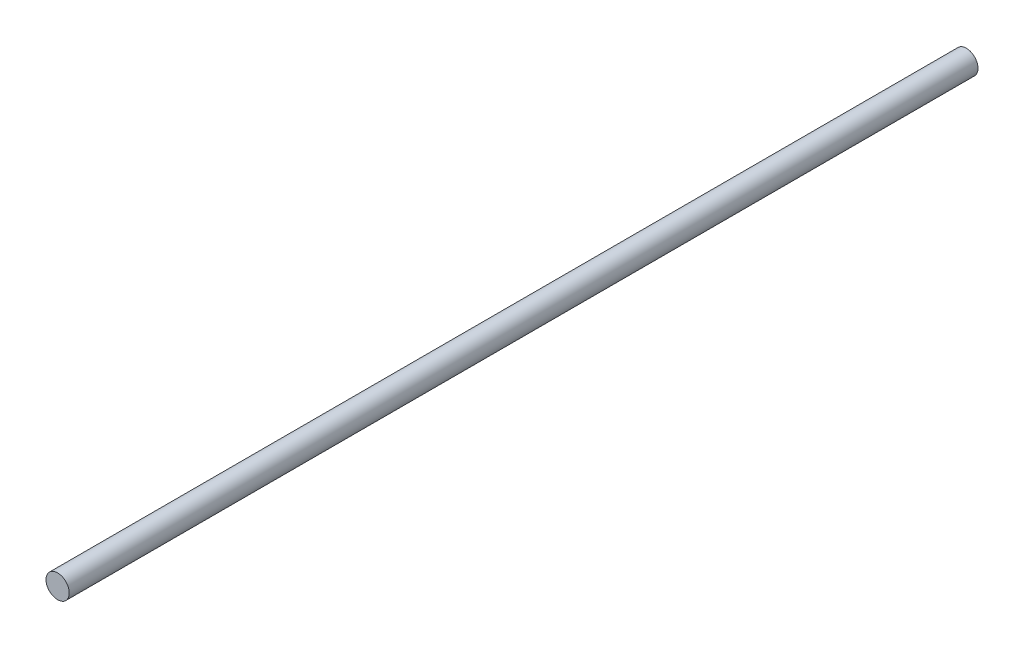
ISO-10303-21;
HEADER;
FILE_DESCRIPTION(('STEP AP214'),'2;1');
FILE_NAME('part.step','',(''),(''),'','','');
FILE_SCHEMA(('AUTOMOTIVE_DESIGN { 1 0 10303 214 1 1 1 1 }'));
ENDSEC;
DATA;
#1=APPLICATION_CONTEXT('core data for automotive mechanical design processes');
#2=APPLICATION_PROTOCOL_DEFINITION('international standard','automotive_design',2000,#1);
#3=PRODUCT_CONTEXT('',#1,'mechanical');
#4=PRODUCT('Part','Part','',(#3));
#5=PRODUCT_RELATED_PRODUCT_CATEGORY('part','',(#4));
#6=PRODUCT_DEFINITION_FORMATION('','',#4);
#7=PRODUCT_DEFINITION_CONTEXT('part definition',#1,'design');
#8=PRODUCT_DEFINITION('design','',#6,#7);
#9=PRODUCT_DEFINITION_SHAPE('','',#8);
#10=(LENGTH_UNIT() NAMED_UNIT(*) SI_UNIT(.MILLI.,.METRE.));
#11=(NAMED_UNIT(*) PLANE_ANGLE_UNIT() SI_UNIT($,.RADIAN.));
#12=(NAMED_UNIT(*) SI_UNIT($,.STERADIAN.) SOLID_ANGLE_UNIT());
#13=UNCERTAINTY_MEASURE_WITH_UNIT(LENGTH_MEASURE(1.E-05),#10,'distance_accuracy_value','');
#14=(GEOMETRIC_REPRESENTATION_CONTEXT(3) GLOBAL_UNCERTAINTY_ASSIGNED_CONTEXT((#13)) GLOBAL_UNIT_ASSIGNED_CONTEXT((#10,
#11,#12)) REPRESENTATION_CONTEXT('',''));
#15=CARTESIAN_POINT('',(0.,0.,0.));
#16=DIRECTION('',(0.,0.,1.));
#17=DIRECTION('',(1.,0.,0.));
#18=AXIS2_PLACEMENT_3D('',#15,#16,#17);
#19=CARTESIAN_POINT('',(0.,0.,312.45));
#20=DIRECTION('',(0.,0.,-1.));
#21=DIRECTION('',(-1.,0.,0.));
#22=AXIS2_PLACEMENT_3D('',#19,#20,#21);
#23=CYLINDRICAL_SURFACE('',#22,4.);
#24=CARTESIAN_POINT('',(0.,0.,312.45));
#25=DIRECTION('',(0.,0.,1.));
#26=DIRECTION('',(1.,0.,0.));
#27=AXIS2_PLACEMENT_3D('',#24,#25,#26);
#28=CIRCLE('',#27,4.);
#29=CARTESIAN_POINT('',(4.,0.,312.45));
#30=VERTEX_POINT('',#29);
#31=EDGE_CURVE('E10',#30,#30,#28,.T.);
#32=ORIENTED_EDGE('',*,*,#31,.F.);
#33=EDGE_LOOP('',(#32));
#34=FACE_BOUND('',#33,.T.);
#35=CARTESIAN_POINT('',(0.,0.,0.));
#36=DIRECTION('',(0.,0.,1.));
#37=DIRECTION('',(1.,0.,0.));
#38=AXIS2_PLACEMENT_3D('',#35,#36,#37);
#39=CIRCLE('',#38,4.);
#40=CARTESIAN_POINT('',(4.,0.,0.));
#41=VERTEX_POINT('',#40);
#42=EDGE_CURVE('E34',#41,#41,#39,.T.);
#43=ORIENTED_EDGE('',*,*,#42,.T.);
#44=EDGE_LOOP('',(#43));
#45=FACE_BOUND('',#44,.T.);
#46=ADVANCED_FACE('F31',(#34,#45),#23,.T.);
#47=CARTESIAN_POINT('',(0.,0.,312.45));
#48=DIRECTION('',(0.,0.,1.));
#49=DIRECTION('',(1.,0.,0.));
#50=AXIS2_PLACEMENT_3D('',#47,#48,#49);
#51=PLANE('',#50);
#52=ORIENTED_EDGE('',*,*,#31,.T.);
#53=EDGE_LOOP('',(#52));
#54=FACE_BOUND('',#53,.T.);
#55=ADVANCED_FACE('F46',(#54),#51,.T.);
#56=CARTESIAN_POINT('',(0.,0.,0.));
#57=DIRECTION('',(0.,0.,1.));
#58=DIRECTION('',(1.,0.,0.));
#59=AXIS2_PLACEMENT_3D('',#56,#57,#58);
#60=PLANE('',#59);
#61=ORIENTED_EDGE('',*,*,#42,.F.);
#62=EDGE_LOOP('',(#61));
#63=FACE_BOUND('',#62,.T.);
#64=ADVANCED_FACE('F44',(#63),#60,.F.);
#65=CLOSED_SHELL('',(#46,#55,#64));
#66=MANIFOLD_SOLID_BREP('B2',#65);
#67=ADVANCED_BREP_SHAPE_REPRESENTATION('',(#18,#66),#14);
#68=SHAPE_DEFINITION_REPRESENTATION(#9,#67);
ENDSEC;
END-ISO-10303-21;
